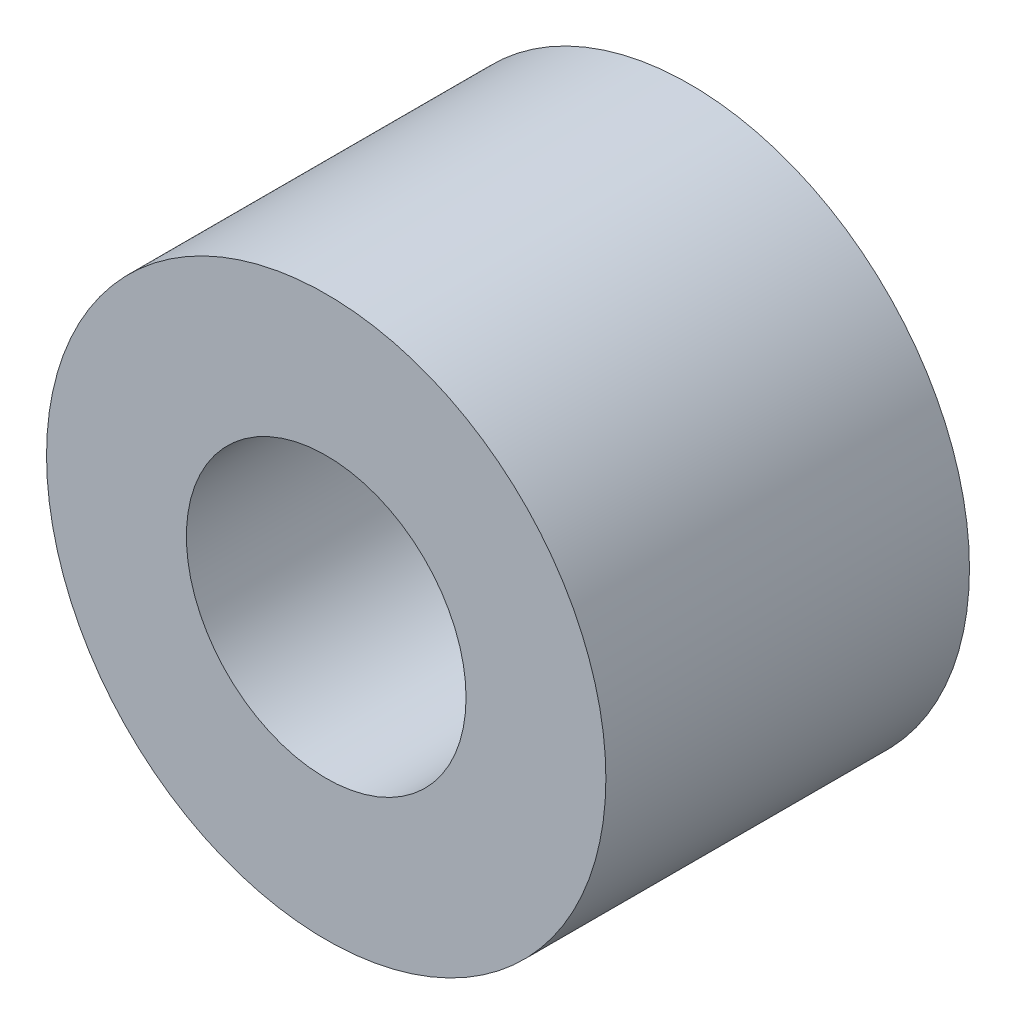
ISO-10303-21;
HEADER;
FILE_DESCRIPTION(('STEP AP214'),'2;1');
FILE_NAME('part.step','',(''),(''),'','','');
FILE_SCHEMA(('AUTOMOTIVE_DESIGN { 1 0 10303 214 1 1 1 1 }'));
ENDSEC;
DATA;
#1=APPLICATION_CONTEXT('core data for automotive mechanical design processes');
#2=APPLICATION_PROTOCOL_DEFINITION('international standard','automotive_design',2000,#1);
#3=PRODUCT_CONTEXT('',#1,'mechanical');
#4=PRODUCT('Part','Part','',(#3));
#5=PRODUCT_RELATED_PRODUCT_CATEGORY('part','',(#4));
#6=PRODUCT_DEFINITION_FORMATION('','',#4);
#7=PRODUCT_DEFINITION_CONTEXT('part definition',#1,'design');
#8=PRODUCT_DEFINITION('design','',#6,#7);
#9=PRODUCT_DEFINITION_SHAPE('','',#8);
#10=(LENGTH_UNIT() NAMED_UNIT(*) SI_UNIT(.MILLI.,.METRE.));
#11=(NAMED_UNIT(*) PLANE_ANGLE_UNIT() SI_UNIT($,.RADIAN.));
#12=(NAMED_UNIT(*) SI_UNIT($,.STERADIAN.) SOLID_ANGLE_UNIT());
#13=UNCERTAINTY_MEASURE_WITH_UNIT(LENGTH_MEASURE(1.E-05),#10,'distance_accuracy_value','');
#14=(GEOMETRIC_REPRESENTATION_CONTEXT(3) GLOBAL_UNCERTAINTY_ASSIGNED_CONTEXT((#13)) GLOBAL_UNIT_ASSIGNED_CONTEXT((#10,
#11,#12)) REPRESENTATION_CONTEXT('',''));
#15=CARTESIAN_POINT('',(0.,0.,0.));
#16=DIRECTION('',(0.,0.,1.));
#17=DIRECTION('',(1.,0.,0.));
#18=AXIS2_PLACEMENT_3D('',#15,#16,#17);
#19=CARTESIAN_POINT('',(0.,0.,6.5));
#20=DIRECTION('',(0.,0.,1.));
#21=DIRECTION('',(1.,0.,0.));
#22=AXIS2_PLACEMENT_3D('',#19,#20,#21);
#23=PLANE('',#22);
#24=CARTESIAN_POINT('',(0.,0.,6.5));
#25=DIRECTION('',(0.,0.,1.));
#26=DIRECTION('',(1.,0.,0.));
#27=AXIS2_PLACEMENT_3D('',#24,#25,#26);
#28=CIRCLE('',#27,5.);
#29=CARTESIAN_POINT('',(5.,0.,6.5));
#30=VERTEX_POINT('',#29);
#31=EDGE_CURVE('E10',#30,#30,#28,.T.);
#32=ORIENTED_EDGE('',*,*,#31,.T.);
#33=EDGE_LOOP('',(#32));
#34=FACE_BOUND('',#33,.T.);
#35=CARTESIAN_POINT('',(0.,0.,6.5));
#36=DIRECTION('',(0.,0.,1.));
#37=DIRECTION('',(1.,0.,0.));
#38=AXIS2_PLACEMENT_3D('',#35,#36,#37);
#39=CIRCLE('',#38,2.5);
#40=CARTESIAN_POINT('',(2.5,0.,6.5));
#41=VERTEX_POINT('',#40);
#42=EDGE_CURVE('E54',#41,#41,#39,.T.);
#43=ORIENTED_EDGE('',*,*,#42,.F.);
#44=EDGE_LOOP('',(#43));
#45=FACE_BOUND('',#44,.T.);
#46=ADVANCED_FACE('F41',(#34,#45),#23,.T.);
#47=CARTESIAN_POINT('',(0.,0.,0.));
#48=DIRECTION('',(0.,0.,1.));
#49=DIRECTION('',(1.,0.,0.));
#50=AXIS2_PLACEMENT_3D('',#47,#48,#49);
#51=PLANE('',#50);
#52=CARTESIAN_POINT('',(0.,0.,0.));
#53=DIRECTION('',(0.,0.,1.));
#54=DIRECTION('',(1.,0.,0.));
#55=AXIS2_PLACEMENT_3D('',#52,#53,#54);
#56=CIRCLE('',#55,5.);
#57=CARTESIAN_POINT('',(5.,0.,0.));
#58=VERTEX_POINT('',#57);
#59=EDGE_CURVE('E45',#58,#58,#56,.T.);
#60=ORIENTED_EDGE('',*,*,#59,.F.);
#61=EDGE_LOOP('',(#60));
#62=FACE_BOUND('',#61,.T.);
#63=CARTESIAN_POINT('',(0.,0.,0.));
#64=DIRECTION('',(0.,0.,1.));
#65=DIRECTION('',(1.,0.,0.));
#66=AXIS2_PLACEMENT_3D('',#63,#64,#65);
#67=CIRCLE('',#66,2.5);
#68=CARTESIAN_POINT('',(2.5,0.,0.));
#69=VERTEX_POINT('',#68);
#70=EDGE_CURVE('E56',#69,#69,#67,.T.);
#71=ORIENTED_EDGE('',*,*,#70,.T.);
#72=EDGE_LOOP('',(#71));
#73=FACE_BOUND('',#72,.T.);
#74=ADVANCED_FACE('F68',(#62,#73),#51,.F.);
#75=CARTESIAN_POINT('',(0.,0.,6.5));
#76=DIRECTION('',(0.,0.,-1.));
#77=DIRECTION('',(-1.,0.,0.));
#78=AXIS2_PLACEMENT_3D('',#75,#76,#77);
#79=CYLINDRICAL_SURFACE('',#78,5.);
#80=ORIENTED_EDGE('',*,*,#31,.F.);
#81=EDGE_LOOP('',(#80));
#82=FACE_BOUND('',#81,.T.);
#83=ORIENTED_EDGE('',*,*,#59,.T.);
#84=EDGE_LOOP('',(#83));
#85=FACE_BOUND('',#84,.T.);
#86=ADVANCED_FACE('F43',(#82,#85),#79,.T.);
#87=CARTESIAN_POINT('',(0.,0.,6.5));
#88=DIRECTION('',(0.,0.,-1.));
#89=DIRECTION('',(-1.,0.,0.));
#90=AXIS2_PLACEMENT_3D('',#87,#88,#89);
#91=CYLINDRICAL_SURFACE('',#90,2.5);
#92=ORIENTED_EDGE('',*,*,#42,.T.);
#93=EDGE_LOOP('',(#92));
#94=FACE_BOUND('',#93,.T.);
#95=ORIENTED_EDGE('',*,*,#70,.F.);
#96=EDGE_LOOP('',(#95));
#97=FACE_BOUND('',#96,.T.);
#98=ADVANCED_FACE('F64',(#94,#97),#91,.F.);
#99=CLOSED_SHELL('',(#46,#74,#86,#98));
#100=MANIFOLD_SOLID_BREP('B2',#99);
#101=ADVANCED_BREP_SHAPE_REPRESENTATION('',(#18,#100),#14);
#102=SHAPE_DEFINITION_REPRESENTATION(#9,#101);
ENDSEC;
END-ISO-10303-21;
